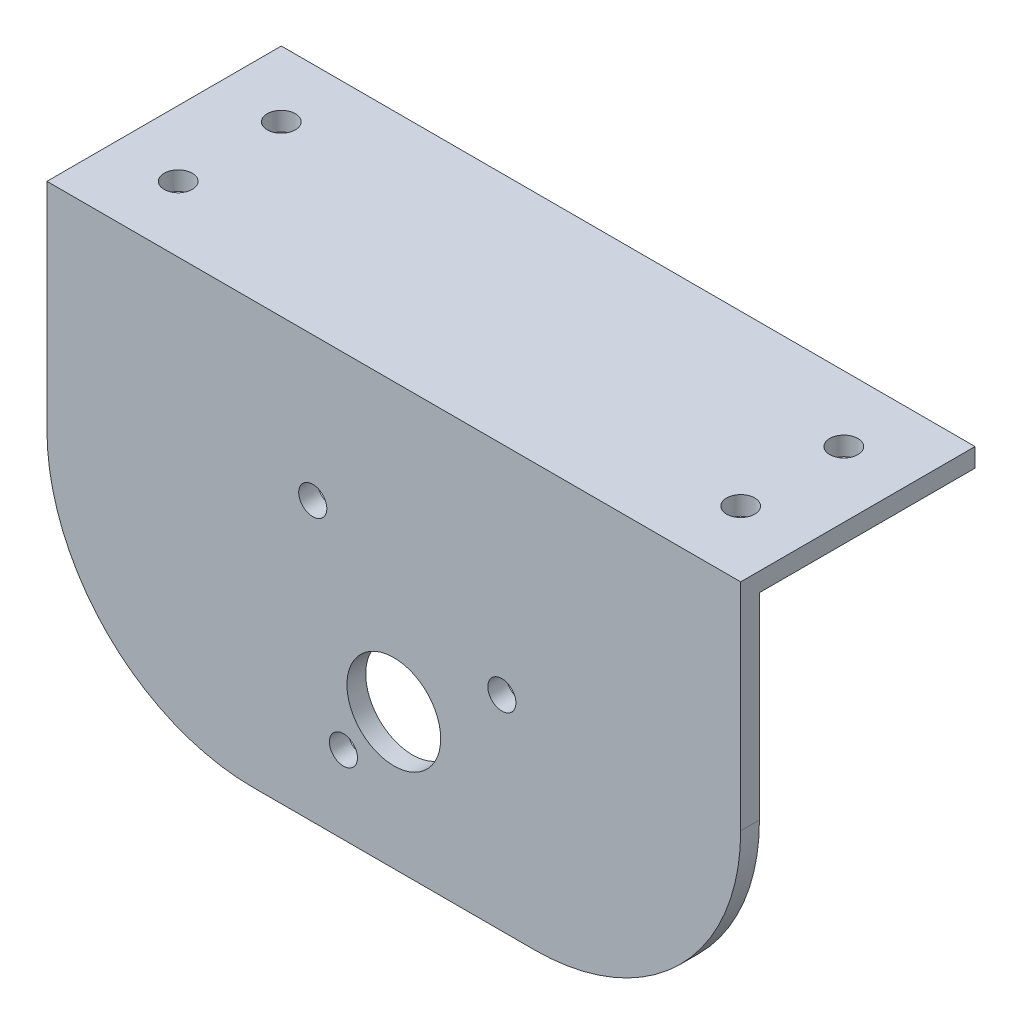
ISO-10303-21;
HEADER;
FILE_DESCRIPTION(('STEP AP214'),'2;1');
FILE_NAME('part.step','',(''),(''),'','','');
FILE_SCHEMA(('AUTOMOTIVE_DESIGN { 1 0 10303 214 1 1 1 1 }'));
ENDSEC;
DATA;
#1=APPLICATION_CONTEXT('core data for automotive mechanical design processes');
#2=APPLICATION_PROTOCOL_DEFINITION('international standard','automotive_design',2000,#1);
#3=PRODUCT_CONTEXT('',#1,'mechanical');
#4=PRODUCT('Part','Part','',(#3));
#5=PRODUCT_RELATED_PRODUCT_CATEGORY('part','',(#4));
#6=PRODUCT_DEFINITION_FORMATION('','',#4);
#7=PRODUCT_DEFINITION_CONTEXT('part definition',#1,'design');
#8=PRODUCT_DEFINITION('design','',#6,#7);
#9=PRODUCT_DEFINITION_SHAPE('','',#8);
#10=(LENGTH_UNIT() NAMED_UNIT(*) SI_UNIT(.MILLI.,.METRE.));
#11=(NAMED_UNIT(*) PLANE_ANGLE_UNIT() SI_UNIT($,.RADIAN.));
#12=(NAMED_UNIT(*) SI_UNIT($,.STERADIAN.) SOLID_ANGLE_UNIT());
#13=UNCERTAINTY_MEASURE_WITH_UNIT(LENGTH_MEASURE(1.E-05),#10,'distance_accuracy_value','');
#14=(GEOMETRIC_REPRESENTATION_CONTEXT(3) GLOBAL_UNCERTAINTY_ASSIGNED_CONTEXT((#13)) GLOBAL_UNIT_ASSIGNED_CONTEXT((#10,
#11,#12)) REPRESENTATION_CONTEXT('',''));
#15=CARTESIAN_POINT('',(0.,0.,0.));
#16=DIRECTION('',(0.,0.,1.));
#17=DIRECTION('',(1.,0.,0.));
#18=AXIS2_PLACEMENT_3D('',#15,#16,#17);
#19=CARTESIAN_POINT('',(0.,0.,0.));
#20=DIRECTION('',(0.,-1.,0.));
#21=DIRECTION('',(0.,0.,-1.));
#22=AXIS2_PLACEMENT_3D('',#19,#20,#21);
#23=PLANE('',#22);
#24=CARTESIAN_POINT('',(67.,0.,-7.));
#25=DIRECTION('',(0.,1.,0.));
#26=DIRECTION('',(0.,0.,1.));
#27=AXIS2_PLACEMENT_3D('',#24,#25,#26);
#28=CIRCLE('',#27,1.5);
#29=CARTESIAN_POINT('',(67.,0.,-5.50000000000001));
#30=VERTEX_POINT('',#29);
#31=EDGE_CURVE('E148',#30,#30,#28,.T.);
#32=ORIENTED_EDGE('',*,*,#31,.T.);
#33=EDGE_LOOP('',(#32));
#34=FACE_BOUND('',#33,.T.);
#35=CARTESIAN_POINT('',(67.,0.,-18.));
#36=DIRECTION('',(0.,1.,0.));
#37=DIRECTION('',(0.,0.,1.));
#38=AXIS2_PLACEMENT_3D('',#35,#36,#37);
#39=CIRCLE('',#38,1.5);
#40=CARTESIAN_POINT('',(67.,0.,-16.5));
#41=VERTEX_POINT('',#40);
#42=EDGE_CURVE('E136',#41,#41,#39,.T.);
#43=ORIENTED_EDGE('',*,*,#42,.T.);
#44=EDGE_LOOP('',(#43));
#45=FACE_BOUND('',#44,.T.);
#46=CARTESIAN_POINT('',(7.,0.,-18.));
#47=DIRECTION('',(0.,1.,0.));
#48=DIRECTION('',(0.,0.,1.));
#49=AXIS2_PLACEMENT_3D('',#46,#47,#48);
#50=CIRCLE('',#49,1.5);
#51=CARTESIAN_POINT('',(7.,0.,-16.5));
#52=VERTEX_POINT('',#51);
#53=EDGE_CURVE('E130',#52,#52,#50,.T.);
#54=ORIENTED_EDGE('',*,*,#53,.T.);
#55=EDGE_LOOP('',(#54));
#56=FACE_BOUND('',#55,.T.);
#57=CARTESIAN_POINT('',(7.,0.,-7.));
#58=DIRECTION('',(0.,1.,0.));
#59=DIRECTION('',(0.,0.,1.));
#60=AXIS2_PLACEMENT_3D('',#57,#58,#59);
#61=CIRCLE('',#60,1.5);
#62=CARTESIAN_POINT('',(7.,0.,-5.5));
#63=VERTEX_POINT('',#62);
#64=EDGE_CURVE('E142',#63,#63,#61,.T.);
#65=ORIENTED_EDGE('',*,*,#64,.T.);
#66=EDGE_LOOP('',(#65));
#67=FACE_BOUND('',#66,.T.);
#68=DIRECTION('',(0.,0.,-1.));
#69=VECTOR('',#68,1.);
#70=CARTESIAN_POINT('',(74.,0.,0.));
#71=LINE('',#70,#69);
#72=CARTESIAN_POINT('',(74.,0.,-2.));
#73=VERTEX_POINT('',#72);
#74=CARTESIAN_POINT('',(74.,0.,-25.));
#75=VERTEX_POINT('',#74);
#76=EDGE_CURVE('E63',#73,#75,#71,.T.);
#77=ORIENTED_EDGE('',*,*,#76,.F.);
#78=DIRECTION('',(-1.,0.,0.));
#79=VECTOR('',#78,1.);
#80=CARTESIAN_POINT('',(0.,0.,-2.));
#81=LINE('',#80,#79);
#82=CARTESIAN_POINT('',(0.,0.,-2.));
#83=VERTEX_POINT('',#82);
#84=EDGE_CURVE('E74',#73,#83,#81,.T.);
#85=ORIENTED_EDGE('',*,*,#84,.T.);
#86=DIRECTION('',(0.,0.,1.));
#87=VECTOR('',#86,1.);
#88=CARTESIAN_POINT('',(0.,0.,0.));
#89=LINE('',#88,#87);
#90=CARTESIAN_POINT('',(0.,0.,-25.));
#91=VERTEX_POINT('',#90);
#92=EDGE_CURVE('E109',#91,#83,#89,.T.);
#93=ORIENTED_EDGE('',*,*,#92,.F.);
#94=DIRECTION('',(-1.,0.,0.));
#95=VECTOR('',#94,1.);
#96=CARTESIAN_POINT('',(0.,0.,-25.));
#97=LINE('',#96,#95);
#98=EDGE_CURVE('E114',#75,#91,#97,.T.);
#99=ORIENTED_EDGE('',*,*,#98,.F.);
#100=EDGE_LOOP('',(#77,#85,#93,#99));
#101=FACE_BOUND('',#100,.T.);
#102=ADVANCED_FACE('F34',(#34,#45,#56,#67,#101),#23,.T.);
#103=CARTESIAN_POINT('',(0.,2.,0.));
#104=DIRECTION('',(0.,-1.,0.));
#105=DIRECTION('',(0.,0.,-1.));
#106=AXIS2_PLACEMENT_3D('',#103,#104,#105);
#107=PLANE('',#106);
#108=DIRECTION('',(0.,0.,-1.));
#109=VECTOR('',#108,1.);
#110=CARTESIAN_POINT('',(74.,2.,0.));
#111=LINE('',#110,#109);
#112=CARTESIAN_POINT('',(74.,2.,0.));
#113=VERTEX_POINT('',#112);
#114=CARTESIAN_POINT('',(74.,2.,-25.));
#115=VERTEX_POINT('',#114);
#116=EDGE_CURVE('E86',#113,#115,#111,.T.);
#117=ORIENTED_EDGE('',*,*,#116,.T.);
#118=DIRECTION('',(-1.,0.,0.));
#119=VECTOR('',#118,1.);
#120=CARTESIAN_POINT('',(0.,2.,-25.));
#121=LINE('',#120,#119);
#122=CARTESIAN_POINT('',(0.,2.,-25.));
#123=VERTEX_POINT('',#122);
#124=EDGE_CURVE('E51',#115,#123,#121,.T.);
#125=ORIENTED_EDGE('',*,*,#124,.T.);
#126=DIRECTION('',(0.,0.,1.));
#127=VECTOR('',#126,1.);
#128=CARTESIAN_POINT('',(0.,2.,0.));
#129=LINE('',#128,#127);
#130=CARTESIAN_POINT('',(0.,2.,0.));
#131=VERTEX_POINT('',#130);
#132=EDGE_CURVE('E88',#123,#131,#129,.T.);
#133=ORIENTED_EDGE('',*,*,#132,.T.);
#134=DIRECTION('',(1.,0.,0.));
#135=VECTOR('',#134,1.);
#136=CARTESIAN_POINT('',(0.,2.,0.));
#137=LINE('',#136,#135);
#138=EDGE_CURVE('E81',#131,#113,#137,.T.);
#139=ORIENTED_EDGE('',*,*,#138,.T.);
#140=EDGE_LOOP('',(#117,#125,#133,#139));
#141=FACE_BOUND('',#140,.T.);
#142=CARTESIAN_POINT('',(67.,2.,-7.));
#143=DIRECTION('',(0.,1.,0.));
#144=DIRECTION('',(0.,0.,1.));
#145=AXIS2_PLACEMENT_3D('',#142,#143,#144);
#146=CIRCLE('',#145,1.5);
#147=CARTESIAN_POINT('',(67.,2.,-5.50000000000001));
#148=VERTEX_POINT('',#147);
#149=EDGE_CURVE('E145',#148,#148,#146,.T.);
#150=ORIENTED_EDGE('',*,*,#149,.F.);
#151=EDGE_LOOP('',(#150));
#152=FACE_BOUND('',#151,.T.);
#153=CARTESIAN_POINT('',(67.,2.,-18.));
#154=DIRECTION('',(0.,1.,0.));
#155=DIRECTION('',(0.,0.,1.));
#156=AXIS2_PLACEMENT_3D('',#153,#154,#155);
#157=CIRCLE('',#156,1.5);
#158=CARTESIAN_POINT('',(67.,2.,-16.5));
#159=VERTEX_POINT('',#158);
#160=EDGE_CURVE('E133',#159,#159,#157,.T.);
#161=ORIENTED_EDGE('',*,*,#160,.F.);
#162=EDGE_LOOP('',(#161));
#163=FACE_BOUND('',#162,.T.);
#164=CARTESIAN_POINT('',(7.,2.,-18.));
#165=DIRECTION('',(0.,1.,0.));
#166=DIRECTION('',(0.,0.,1.));
#167=AXIS2_PLACEMENT_3D('',#164,#165,#166);
#168=CIRCLE('',#167,1.5);
#169=CARTESIAN_POINT('',(7.,2.,-16.5));
#170=VERTEX_POINT('',#169);
#171=EDGE_CURVE('E112',#170,#170,#168,.T.);
#172=ORIENTED_EDGE('',*,*,#171,.F.);
#173=EDGE_LOOP('',(#172));
#174=FACE_BOUND('',#173,.T.);
#175=CARTESIAN_POINT('',(7.,2.,-7.));
#176=DIRECTION('',(0.,1.,0.));
#177=DIRECTION('',(0.,0.,1.));
#178=AXIS2_PLACEMENT_3D('',#175,#176,#177);
#179=CIRCLE('',#178,1.5);
#180=CARTESIAN_POINT('',(7.,2.,-5.5));
#181=VERTEX_POINT('',#180);
#182=EDGE_CURVE('E139',#181,#181,#179,.T.);
#183=ORIENTED_EDGE('',*,*,#182,.F.);
#184=EDGE_LOOP('',(#183));
#185=FACE_BOUND('',#184,.T.);
#186=ADVANCED_FACE('F83',(#141,#152,#163,#174,#185),#107,.F.);
#187=CARTESIAN_POINT('',(0.,2.,0.));
#188=DIRECTION('',(1.,0.,0.));
#189=DIRECTION('',(0.,0.,-1.));
#190=AXIS2_PLACEMENT_3D('',#187,#188,#189);
#191=PLANE('',#190);
#192=DIRECTION('',(0.,-1.,0.));
#193=VECTOR('',#192,1.);
#194=CARTESIAN_POINT('',(0.,2.,0.));
#195=LINE('',#194,#193);
#196=CARTESIAN_POINT('',(0.,-20.9999999999998,0.));
#197=VERTEX_POINT('',#196);
#198=EDGE_CURVE('E11',#131,#197,#195,.T.);
#199=ORIENTED_EDGE('',*,*,#198,.F.);
#200=ORIENTED_EDGE('',*,*,#132,.F.);
#201=DIRECTION('',(0.,-1.,0.));
#202=VECTOR('',#201,1.);
#203=CARTESIAN_POINT('',(0.,2.,-25.));
#204=LINE('',#203,#202);
#205=EDGE_CURVE('E105',#123,#91,#204,.T.);
#206=ORIENTED_EDGE('',*,*,#205,.T.);
#207=ORIENTED_EDGE('',*,*,#92,.T.);
#208=DIRECTION('',(0.,-1.,0.));
#209=VECTOR('',#208,1.);
#210=CARTESIAN_POINT('',(0.,2.,-2.));
#211=LINE('',#210,#209);
#212=CARTESIAN_POINT('',(0.,-20.9999999999998,-2.));
#213=VERTEX_POINT('',#212);
#214=EDGE_CURVE('E127',#83,#213,#211,.T.);
#215=ORIENTED_EDGE('',*,*,#214,.T.);
#216=DIRECTION('',(0.,0.,1.));
#217=VECTOR('',#216,1.);
#218=CARTESIAN_POINT('',(0.,-20.9999999999998,-2.));
#219=LINE('',#218,#217);
#220=EDGE_CURVE('E155',#213,#197,#219,.T.);
#221=ORIENTED_EDGE('',*,*,#220,.T.);
#222=EDGE_LOOP('',(#199,#200,#206,#207,#215,#221));
#223=FACE_BOUND('',#222,.T.);
#224=ADVANCED_FACE('F36',(#223),#191,.F.);
#225=CARTESIAN_POINT('',(0.,2.,0.));
#226=DIRECTION('',(0.,0.,-1.));
#227=DIRECTION('',(-1.,0.,0.));
#228=AXIS2_PLACEMENT_3D('',#225,#226,#227);
#229=PLANE('',#228);
#230=ORIENTED_EDGE('',*,*,#198,.T.);
#231=CARTESIAN_POINT('',(22.,-21.,0.));
#232=DIRECTION('',(0.,0.,1.));
#233=DIRECTION('',(1.,0.,0.));
#234=AXIS2_PLACEMENT_3D('',#231,#232,#233);
#235=CIRCLE('',#234,22.);
#236=CARTESIAN_POINT('',(22.0000000000002,-43.,0.));
#237=VERTEX_POINT('',#236);
#238=EDGE_CURVE('E168',#197,#237,#235,.T.);
#239=ORIENTED_EDGE('',*,*,#238,.T.);
#240=DIRECTION('',(1.,0.,0.));
#241=VECTOR('',#240,1.);
#242=CARTESIAN_POINT('',(22.0000000000002,-43.,0.));
#243=LINE('',#242,#241);
#244=CARTESIAN_POINT('',(51.9999999999998,-43.,0.));
#245=VERTEX_POINT('',#244);
#246=EDGE_CURVE('E166',#237,#245,#243,.T.);
#247=ORIENTED_EDGE('',*,*,#246,.T.);
#248=CARTESIAN_POINT('',(52.,-21.,0.));
#249=DIRECTION('',(0.,0.,1.));
#250=DIRECTION('',(1.,0.,0.));
#251=AXIS2_PLACEMENT_3D('',#248,#249,#250);
#252=CIRCLE('',#251,22.);
#253=CARTESIAN_POINT('',(74.,-20.9999999999998,0.));
#254=VERTEX_POINT('',#253);
#255=EDGE_CURVE('E99',#245,#254,#252,.T.);
#256=ORIENTED_EDGE('',*,*,#255,.T.);
#257=DIRECTION('',(0.,-1.,0.));
#258=VECTOR('',#257,1.);
#259=CARTESIAN_POINT('',(74.,2.,0.));
#260=LINE('',#259,#258);
#261=EDGE_CURVE('E43',#113,#254,#260,.T.);
#262=ORIENTED_EDGE('',*,*,#261,.F.);
#263=ORIENTED_EDGE('',*,*,#138,.F.);
#264=EDGE_LOOP('',(#230,#239,#247,#256,#262,#263));
#265=FACE_BOUND('',#264,.T.);
#266=CARTESIAN_POINT('',(31.6267563454795,-34.7088452717711,0.));
#267=DIRECTION('',(0.,0.,1.));
#268=DIRECTION('',(1.,0.,0.));
#269=AXIS2_PLACEMENT_3D('',#266,#267,#268);
#270=CIRCLE('',#269,1.5);
#271=CARTESIAN_POINT('',(33.1267563454795,-34.7088452717711,0.));
#272=VERTEX_POINT('',#271);
#273=EDGE_CURVE('E201',#272,#272,#270,.T.);
#274=ORIENTED_EDGE('',*,*,#273,.F.);
#275=EDGE_LOOP('',(#274));
#276=FACE_BOUND('',#275,.T.);
#277=CARTESIAN_POINT('',(48.5250282215109,-21.1737646438721,0.));
#278=DIRECTION('',(0.,0.,1.));
#279=DIRECTION('',(1.,0.,0.));
#280=AXIS2_PLACEMENT_3D('',#277,#278,#279);
#281=CIRCLE('',#280,1.5);
#282=CARTESIAN_POINT('',(50.0250282215109,-21.1737646438721,0.));
#283=VERTEX_POINT('',#282);
#284=EDGE_CURVE('E195',#283,#283,#281,.T.);
#285=ORIENTED_EDGE('',*,*,#284,.F.);
#286=EDGE_LOOP('',(#285));
#287=FACE_BOUND('',#286,.T.);
#288=CARTESIAN_POINT('',(28.354168617464,-13.3069722331223,0.));
#289=DIRECTION('',(0.,0.,1.));
#290=DIRECTION('',(1.,0.,0.));
#291=AXIS2_PLACEMENT_3D('',#288,#289,#290);
#292=CIRCLE('',#291,1.5);
#293=CARTESIAN_POINT('',(29.854168617464,-13.3069722331223,0.));
#294=VERTEX_POINT('',#293);
#295=EDGE_CURVE('E189',#294,#294,#292,.T.);
#296=ORIENTED_EDGE('',*,*,#295,.F.);
#297=EDGE_LOOP('',(#296));
#298=FACE_BOUND('',#297,.T.);
#299=CARTESIAN_POINT('',(37.,-28.5,0.));
#300=DIRECTION('',(0.,0.,1.));
#301=DIRECTION('',(1.,0.,0.));
#302=AXIS2_PLACEMENT_3D('',#299,#300,#301);
#303=CIRCLE('',#302,5.);
#304=CARTESIAN_POINT('',(42.,-28.5,0.));
#305=VERTEX_POINT('',#304);
#306=EDGE_CURVE('E183',#305,#305,#303,.T.);
#307=ORIENTED_EDGE('',*,*,#306,.F.);
#308=EDGE_LOOP('',(#307));
#309=FACE_BOUND('',#308,.T.);
#310=ADVANCED_FACE('F94',(#265,#276,#287,#298,#309),#229,.F.);
#311=CARTESIAN_POINT('',(74.,2.,0.));
#312=DIRECTION('',(-1.,0.,0.));
#313=DIRECTION('',(0.,0.,1.));
#314=AXIS2_PLACEMENT_3D('',#311,#312,#313);
#315=PLANE('',#314);
#316=ORIENTED_EDGE('',*,*,#261,.T.);
#317=DIRECTION('',(0.,0.,1.));
#318=VECTOR('',#317,1.);
#319=CARTESIAN_POINT('',(74.,-20.9999999999998,-2.));
#320=LINE('',#319,#318);
#321=CARTESIAN_POINT('',(74.,-20.9999999999998,-2.));
#322=VERTEX_POINT('',#321);
#323=EDGE_CURVE('E154',#322,#254,#320,.T.);
#324=ORIENTED_EDGE('',*,*,#323,.F.);
#325=DIRECTION('',(0.,1.,0.));
#326=VECTOR('',#325,1.);
#327=CARTESIAN_POINT('',(74.,2.,-2.));
#328=LINE('',#327,#326);
#329=EDGE_CURVE('E158',#322,#73,#328,.T.);
#330=ORIENTED_EDGE('',*,*,#329,.T.);
#331=ORIENTED_EDGE('',*,*,#76,.T.);
#332=DIRECTION('',(0.,-1.,0.));
#333=VECTOR('',#332,1.);
#334=CARTESIAN_POINT('',(74.,2.,-25.));
#335=LINE('',#334,#333);
#336=EDGE_CURVE('E102',#115,#75,#335,.T.);
#337=ORIENTED_EDGE('',*,*,#336,.F.);
#338=ORIENTED_EDGE('',*,*,#116,.F.);
#339=EDGE_LOOP('',(#316,#324,#330,#331,#337,#338));
#340=FACE_BOUND('',#339,.T.);
#341=ADVANCED_FACE('F103',(#340),#315,.F.);
#342=CARTESIAN_POINT('',(0.,2.,-25.));
#343=DIRECTION('',(0.,0.,1.));
#344=DIRECTION('',(1.,0.,0.));
#345=AXIS2_PLACEMENT_3D('',#342,#343,#344);
#346=PLANE('',#345);
#347=ORIENTED_EDGE('',*,*,#98,.T.);
#348=ORIENTED_EDGE('',*,*,#205,.F.);
#349=ORIENTED_EDGE('',*,*,#124,.F.);
#350=ORIENTED_EDGE('',*,*,#336,.T.);
#351=EDGE_LOOP('',(#347,#348,#349,#350));
#352=FACE_BOUND('',#351,.T.);
#353=ADVANCED_FACE('F120',(#352),#346,.F.);
#354=CARTESIAN_POINT('',(7.,2.,-18.));
#355=DIRECTION('',(0.,-1.,0.));
#356=DIRECTION('',(0.,0.,-1.));
#357=AXIS2_PLACEMENT_3D('',#354,#355,#356);
#358=CYLINDRICAL_SURFACE('',#357,1.5);
#359=ORIENTED_EDGE('',*,*,#171,.T.);
#360=EDGE_LOOP('',(#359));
#361=FACE_BOUND('',#360,.T.);
#362=ORIENTED_EDGE('',*,*,#53,.F.);
#363=EDGE_LOOP('',(#362));
#364=FACE_BOUND('',#363,.T.);
#365=ADVANCED_FACE('F250',(#361,#364),#358,.F.);
#366=CARTESIAN_POINT('',(67.,2.,-18.));
#367=DIRECTION('',(0.,-1.,0.));
#368=DIRECTION('',(0.,0.,-1.));
#369=AXIS2_PLACEMENT_3D('',#366,#367,#368);
#370=CYLINDRICAL_SURFACE('',#369,1.5);
#371=ORIENTED_EDGE('',*,*,#160,.T.);
#372=EDGE_LOOP('',(#371));
#373=FACE_BOUND('',#372,.T.);
#374=ORIENTED_EDGE('',*,*,#42,.F.);
#375=EDGE_LOOP('',(#374));
#376=FACE_BOUND('',#375,.T.);
#377=ADVANCED_FACE('F268',(#373,#376),#370,.F.);
#378=CARTESIAN_POINT('',(7.,2.,-7.));
#379=DIRECTION('',(0.,-1.,0.));
#380=DIRECTION('',(0.,0.,-1.));
#381=AXIS2_PLACEMENT_3D('',#378,#379,#380);
#382=CYLINDRICAL_SURFACE('',#381,1.5);
#383=ORIENTED_EDGE('',*,*,#182,.T.);
#384=EDGE_LOOP('',(#383));
#385=FACE_BOUND('',#384,.T.);
#386=ORIENTED_EDGE('',*,*,#64,.F.);
#387=EDGE_LOOP('',(#386));
#388=FACE_BOUND('',#387,.T.);
#389=ADVANCED_FACE('F275',(#385,#388),#382,.F.);
#390=CARTESIAN_POINT('',(67.,2.,-7.));
#391=DIRECTION('',(0.,-1.,0.));
#392=DIRECTION('',(0.,0.,-1.));
#393=AXIS2_PLACEMENT_3D('',#390,#391,#392);
#394=CYLINDRICAL_SURFACE('',#393,1.5);
#395=ORIENTED_EDGE('',*,*,#149,.T.);
#396=EDGE_LOOP('',(#395));
#397=FACE_BOUND('',#396,.T.);
#398=ORIENTED_EDGE('',*,*,#31,.F.);
#399=EDGE_LOOP('',(#398));
#400=FACE_BOUND('',#399,.T.);
#401=ADVANCED_FACE('F283',(#397,#400),#394,.F.);
#402=CARTESIAN_POINT('',(52.,-21.,-2.));
#403=DIRECTION('',(0.,0.,1.));
#404=DIRECTION('',(1.,0.,0.));
#405=AXIS2_PLACEMENT_3D('',#402,#403,#404);
#406=CYLINDRICAL_SURFACE('',#405,22.);
#407=ORIENTED_EDGE('',*,*,#255,.F.);
#408=DIRECTION('',(0.,0.,1.));
#409=VECTOR('',#408,1.);
#410=CARTESIAN_POINT('',(51.9999999999998,-43.,-2.));
#411=LINE('',#410,#409);
#412=CARTESIAN_POINT('',(51.9999999999998,-43.,-2.));
#413=VERTEX_POINT('',#412);
#414=EDGE_CURVE('E161',#413,#245,#411,.T.);
#415=ORIENTED_EDGE('',*,*,#414,.F.);
#416=CARTESIAN_POINT('',(52.,-21.,-2.));
#417=DIRECTION('',(0.,0.,1.));
#418=DIRECTION('',(1.,0.,0.));
#419=AXIS2_PLACEMENT_3D('',#416,#417,#418);
#420=CIRCLE('',#419,22.);
#421=EDGE_CURVE('E173',#413,#322,#420,.T.);
#422=ORIENTED_EDGE('',*,*,#421,.T.);
#423=ORIENTED_EDGE('',*,*,#323,.T.);
#424=EDGE_LOOP('',(#407,#415,#422,#423));
#425=FACE_BOUND('',#424,.T.);
#426=ADVANCED_FACE('F291',(#425),#406,.T.);
#427=CARTESIAN_POINT('',(22.0000000000002,-43.,-2.));
#428=DIRECTION('',(0.,-1.,0.));
#429=DIRECTION('',(0.,0.,-1.));
#430=AXIS2_PLACEMENT_3D('',#427,#428,#429);
#431=PLANE('',#430);
#432=ORIENTED_EDGE('',*,*,#246,.F.);
#433=DIRECTION('',(0.,0.,1.));
#434=VECTOR('',#433,1.);
#435=CARTESIAN_POINT('',(22.0000000000002,-43.,-2.));
#436=LINE('',#435,#434);
#437=CARTESIAN_POINT('',(22.0000000000002,-43.,-2.));
#438=VERTEX_POINT('',#437);
#439=EDGE_CURVE('E157',#438,#237,#436,.T.);
#440=ORIENTED_EDGE('',*,*,#439,.F.);
#441=DIRECTION('',(1.,0.,0.));
#442=VECTOR('',#441,1.);
#443=CARTESIAN_POINT('',(22.0000000000002,-43.,-2.));
#444=LINE('',#443,#442);
#445=EDGE_CURVE('E176',#438,#413,#444,.T.);
#446=ORIENTED_EDGE('',*,*,#445,.T.);
#447=ORIENTED_EDGE('',*,*,#414,.T.);
#448=EDGE_LOOP('',(#432,#440,#446,#447));
#449=FACE_BOUND('',#448,.T.);
#450=ADVANCED_FACE('F298',(#449),#431,.T.);
#451=CARTESIAN_POINT('',(22.,-21.,-2.));
#452=DIRECTION('',(0.,0.,1.));
#453=DIRECTION('',(1.,0.,0.));
#454=AXIS2_PLACEMENT_3D('',#451,#452,#453);
#455=CYLINDRICAL_SURFACE('',#454,22.);
#456=ORIENTED_EDGE('',*,*,#238,.F.);
#457=ORIENTED_EDGE('',*,*,#220,.F.);
#458=CARTESIAN_POINT('',(22.,-21.,-2.));
#459=DIRECTION('',(0.,0.,1.));
#460=DIRECTION('',(1.,0.,0.));
#461=AXIS2_PLACEMENT_3D('',#458,#459,#460);
#462=CIRCLE('',#461,22.);
#463=EDGE_CURVE('E179',#213,#438,#462,.T.);
#464=ORIENTED_EDGE('',*,*,#463,.T.);
#465=ORIENTED_EDGE('',*,*,#439,.T.);
#466=EDGE_LOOP('',(#456,#457,#464,#465));
#467=FACE_BOUND('',#466,.T.);
#468=ADVANCED_FACE('F235',(#467),#455,.T.);
#469=CARTESIAN_POINT('',(22.,-21.,-2.));
#470=DIRECTION('',(0.,0.,1.));
#471=DIRECTION('',(1.,0.,0.));
#472=AXIS2_PLACEMENT_3D('',#469,#470,#471);
#473=PLANE('',#472);
#474=ORIENTED_EDGE('',*,*,#84,.F.);
#475=ORIENTED_EDGE('',*,*,#329,.F.);
#476=ORIENTED_EDGE('',*,*,#421,.F.);
#477=ORIENTED_EDGE('',*,*,#445,.F.);
#478=ORIENTED_EDGE('',*,*,#463,.F.);
#479=ORIENTED_EDGE('',*,*,#214,.F.);
#480=EDGE_LOOP('',(#474,#475,#476,#477,#478,#479));
#481=FACE_BOUND('',#480,.T.);
#482=CARTESIAN_POINT('',(31.6267563454795,-34.7088452717711,-2.));
#483=DIRECTION('',(0.,0.,1.));
#484=DIRECTION('',(1.,0.,0.));
#485=AXIS2_PLACEMENT_3D('',#482,#483,#484);
#486=CIRCLE('',#485,1.5);
#487=CARTESIAN_POINT('',(33.1267563454795,-34.7088452717711,-2.));
#488=VERTEX_POINT('',#487);
#489=EDGE_CURVE('E198',#488,#488,#486,.T.);
#490=ORIENTED_EDGE('',*,*,#489,.T.);
#491=EDGE_LOOP('',(#490));
#492=FACE_BOUND('',#491,.T.);
#493=CARTESIAN_POINT('',(48.5250282215109,-21.1737646438721,-2.));
#494=DIRECTION('',(0.,0.,1.));
#495=DIRECTION('',(1.,0.,0.));
#496=AXIS2_PLACEMENT_3D('',#493,#494,#495);
#497=CIRCLE('',#496,1.5);
#498=CARTESIAN_POINT('',(50.0250282215109,-21.1737646438721,-2.));
#499=VERTEX_POINT('',#498);
#500=EDGE_CURVE('E192',#499,#499,#497,.T.);
#501=ORIENTED_EDGE('',*,*,#500,.T.);
#502=EDGE_LOOP('',(#501));
#503=FACE_BOUND('',#502,.T.);
#504=CARTESIAN_POINT('',(28.354168617464,-13.3069722331223,-2.));
#505=DIRECTION('',(0.,0.,1.));
#506=DIRECTION('',(1.,0.,0.));
#507=AXIS2_PLACEMENT_3D('',#504,#505,#506);
#508=CIRCLE('',#507,1.5);
#509=CARTESIAN_POINT('',(29.854168617464,-13.3069722331223,-2.));
#510=VERTEX_POINT('',#509);
#511=EDGE_CURVE('E186',#510,#510,#508,.T.);
#512=ORIENTED_EDGE('',*,*,#511,.T.);
#513=EDGE_LOOP('',(#512));
#514=FACE_BOUND('',#513,.T.);
#515=CARTESIAN_POINT('',(37.,-28.5,-2.));
#516=DIRECTION('',(0.,0.,1.));
#517=DIRECTION('',(1.,0.,0.));
#518=AXIS2_PLACEMENT_3D('',#515,#516,#517);
#519=CIRCLE('',#518,5.);
#520=CARTESIAN_POINT('',(42.,-28.5,-2.));
#521=VERTEX_POINT('',#520);
#522=EDGE_CURVE('E171',#521,#521,#519,.T.);
#523=ORIENTED_EDGE('',*,*,#522,.T.);
#524=EDGE_LOOP('',(#523));
#525=FACE_BOUND('',#524,.T.);
#526=ADVANCED_FACE('F207',(#481,#492,#503,#514,#525),#473,.F.);
#527=CARTESIAN_POINT('',(37.,-28.5,-2.));
#528=DIRECTION('',(0.,0.,1.));
#529=DIRECTION('',(1.,0.,0.));
#530=AXIS2_PLACEMENT_3D('',#527,#528,#529);
#531=CYLINDRICAL_SURFACE('',#530,5.);
#532=ORIENTED_EDGE('',*,*,#522,.F.);
#533=EDGE_LOOP('',(#532));
#534=FACE_BOUND('',#533,.T.);
#535=ORIENTED_EDGE('',*,*,#306,.T.);
#536=EDGE_LOOP('',(#535));
#537=FACE_BOUND('',#536,.T.);
#538=ADVANCED_FACE('F224',(#534,#537),#531,.F.);
#539=CARTESIAN_POINT('',(28.354168617464,-13.3069722331223,-2.));
#540=DIRECTION('',(0.,0.,1.));
#541=DIRECTION('',(1.,0.,0.));
#542=AXIS2_PLACEMENT_3D('',#539,#540,#541);
#543=CYLINDRICAL_SURFACE('',#542,1.5);
#544=ORIENTED_EDGE('',*,*,#511,.F.);
#545=EDGE_LOOP('',(#544));
#546=FACE_BOUND('',#545,.T.);
#547=ORIENTED_EDGE('',*,*,#295,.T.);
#548=EDGE_LOOP('',(#547));
#549=FACE_BOUND('',#548,.T.);
#550=ADVANCED_FACE('F226',(#546,#549),#543,.F.);
#551=CARTESIAN_POINT('',(48.5250282215109,-21.1737646438721,-2.));
#552=DIRECTION('',(0.,0.,1.));
#553=DIRECTION('',(1.,0.,0.));
#554=AXIS2_PLACEMENT_3D('',#551,#552,#553);
#555=CYLINDRICAL_SURFACE('',#554,1.5);
#556=ORIENTED_EDGE('',*,*,#500,.F.);
#557=EDGE_LOOP('',(#556));
#558=FACE_BOUND('',#557,.T.);
#559=ORIENTED_EDGE('',*,*,#284,.T.);
#560=EDGE_LOOP('',(#559));
#561=FACE_BOUND('',#560,.T.);
#562=ADVANCED_FACE('F213',(#558,#561),#555,.F.);
#563=CARTESIAN_POINT('',(31.6267563454795,-34.7088452717711,-2.));
#564=DIRECTION('',(0.,0.,1.));
#565=DIRECTION('',(1.,0.,0.));
#566=AXIS2_PLACEMENT_3D('',#563,#564,#565);
#567=CYLINDRICAL_SURFACE('',#566,1.5);
#568=ORIENTED_EDGE('',*,*,#489,.F.);
#569=EDGE_LOOP('',(#568));
#570=FACE_BOUND('',#569,.T.);
#571=ORIENTED_EDGE('',*,*,#273,.T.);
#572=EDGE_LOOP('',(#571));
#573=FACE_BOUND('',#572,.T.);
#574=ADVANCED_FACE('F210',(#570,#573),#567,.F.);
#575=CLOSED_SHELL('',(#102,#186,#224,#310,#341,#353,#365,#377,#389,#401,#426,#450,#468,#526,
#538,#550,#562,#574));
#576=MANIFOLD_SOLID_BREP('B2',#575);
#577=ADVANCED_BREP_SHAPE_REPRESENTATION('',(#18,#576),#14);
#578=SHAPE_DEFINITION_REPRESENTATION(#9,#577);
ENDSEC;
END-ISO-10303-21;
